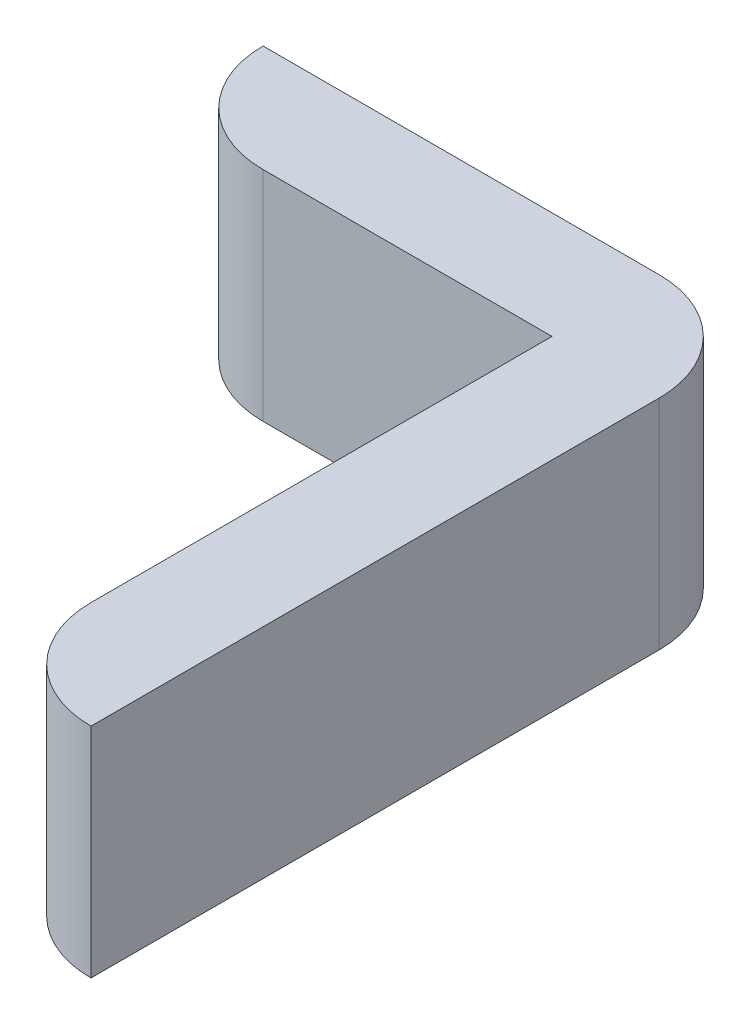
ISO-10303-21;
HEADER;
FILE_DESCRIPTION(('STEP AP214'),'2;1');
FILE_NAME('part.step','',(''),(''),'','','');
FILE_SCHEMA(('AUTOMOTIVE_DESIGN { 1 0 10303 214 1 1 1 1 }'));
ENDSEC;
DATA;
#1=APPLICATION_CONTEXT('core data for automotive mechanical design processes');
#2=APPLICATION_PROTOCOL_DEFINITION('international standard','automotive_design',2000,#1);
#3=PRODUCT_CONTEXT('',#1,'mechanical');
#4=PRODUCT('Part','Part','',(#3));
#5=PRODUCT_RELATED_PRODUCT_CATEGORY('part','',(#4));
#6=PRODUCT_DEFINITION_FORMATION('','',#4);
#7=PRODUCT_DEFINITION_CONTEXT('part definition',#1,'design');
#8=PRODUCT_DEFINITION('design','',#6,#7);
#9=PRODUCT_DEFINITION_SHAPE('','',#8);
#10=(LENGTH_UNIT() NAMED_UNIT(*) SI_UNIT(.MILLI.,.METRE.));
#11=(NAMED_UNIT(*) PLANE_ANGLE_UNIT() SI_UNIT($,.RADIAN.));
#12=(NAMED_UNIT(*) SI_UNIT($,.STERADIAN.) SOLID_ANGLE_UNIT());
#13=UNCERTAINTY_MEASURE_WITH_UNIT(LENGTH_MEASURE(1.E-05),#10,'distance_accuracy_value','');
#14=(GEOMETRIC_REPRESENTATION_CONTEXT(3) GLOBAL_UNCERTAINTY_ASSIGNED_CONTEXT((#13)) GLOBAL_UNIT_ASSIGNED_CONTEXT((#10,
#11,#12)) REPRESENTATION_CONTEXT('',''));
#15=CARTESIAN_POINT('',(0.,0.,0.));
#16=DIRECTION('',(0.,0.,1.));
#17=DIRECTION('',(1.,0.,0.));
#18=AXIS2_PLACEMENT_3D('',#15,#16,#17);
#19=CARTESIAN_POINT('',(-0.125,-7.3652,0.));
#20=DIRECTION('',(0.,-1.,0.));
#21=DIRECTION('',(0.,0.,-1.));
#22=AXIS2_PLACEMENT_3D('',#19,#20,#21);
#23=PLANE('',#22);
#24=DIRECTION('',(-1.,0.,0.));
#25=VECTOR('',#24,1.);
#26=CARTESIAN_POINT('',(0.125,-7.3652,0.25));
#27=LINE('',#26,#25);
#28=CARTESIAN_POINT('',(0.125,-7.3652,0.25));
#29=VERTEX_POINT('',#28);
#30=CARTESIAN_POINT('',(0.8,-7.3652,0.25));
#31=VERTEX_POINT('',#30);
#32=EDGE_CURVE('E102',#29,#31,#27,.F.);
#33=ORIENTED_EDGE('',*,*,#32,.T.);
#34=DIRECTION('',(0.,0.,-1.));
#35=VECTOR('',#34,1.);
#36=CARTESIAN_POINT('',(0.8,-7.3652,0.25));
#37=LINE('',#36,#35);
#38=CARTESIAN_POINT('',(0.8,-7.3652,1.327));
#39=VERTEX_POINT('',#38);
#40=EDGE_CURVE('E108',#31,#39,#37,.F.);
#41=ORIENTED_EDGE('',*,*,#40,.T.);
#42=CARTESIAN_POINT('',(1.05,-7.3652,1.327));
#43=DIRECTION('',(0.,-1.,0.));
#44=DIRECTION('',(0.,0.,-1.));
#45=AXIS2_PLACEMENT_3D('',#42,#43,#44);
#46=CIRCLE('',#45,0.25);
#47=CARTESIAN_POINT('',(1.05,-7.3652,1.577));
#48=VERTEX_POINT('',#47);
#49=EDGE_CURVE('E80',#48,#39,#46,.T.);
#50=ORIENTED_EDGE('',*,*,#49,.F.);
#51=DIRECTION('',(0.,0.,1.));
#52=VECTOR('',#51,1.);
#53=CARTESIAN_POINT('',(1.05,-7.3652,1.577));
#54=LINE('',#53,#52);
#55=CARTESIAN_POINT('',(1.05,-7.3652,0.25));
#56=VERTEX_POINT('',#55);
#57=EDGE_CURVE('E75',#48,#56,#54,.F.);
#58=ORIENTED_EDGE('',*,*,#57,.T.);
#59=CARTESIAN_POINT('',(0.8,-7.3652,0.25));
#60=DIRECTION('',(0.,-1.,0.));
#61=DIRECTION('',(0.,0.,-1.));
#62=AXIS2_PLACEMENT_3D('',#59,#60,#61);
#63=CIRCLE('',#62,0.25);
#64=CARTESIAN_POINT('',(0.8,-7.3652,0.));
#65=VERTEX_POINT('',#64);
#66=EDGE_CURVE('E19',#65,#56,#63,.T.);
#67=ORIENTED_EDGE('',*,*,#66,.F.);
#68=DIRECTION('',(1.,0.,0.));
#69=VECTOR('',#68,1.);
#70=CARTESIAN_POINT('',(0.8,-7.3652,0.));
#71=LINE('',#70,#69);
#72=CARTESIAN_POINT('',(-0.125,-7.3652,0.));
#73=VERTEX_POINT('',#72);
#74=EDGE_CURVE('E70',#65,#73,#71,.F.);
#75=ORIENTED_EDGE('',*,*,#74,.T.);
#76=CARTESIAN_POINT('',(0.125,-7.3652,0.));
#77=DIRECTION('',(0.,-1.,0.));
#78=DIRECTION('',(0.,0.,-1.));
#79=AXIS2_PLACEMENT_3D('',#76,#77,#78);
#80=CIRCLE('',#79,0.25);
#81=EDGE_CURVE('E121',#29,#73,#80,.T.);
#82=ORIENTED_EDGE('',*,*,#81,.F.);
#83=EDGE_LOOP('',(#33,#41,#50,#58,#67,#75,#82));
#84=FACE_BOUND('',#83,.T.);
#85=ADVANCED_FACE('F16',(#84),#23,.F.);
#86=CARTESIAN_POINT('',(0.8,-7.8748,0.));
#87=DIRECTION('',(0.,0.,1.));
#88=DIRECTION('',(1.,0.,0.));
#89=AXIS2_PLACEMENT_3D('',#86,#87,#88);
#90=PLANE('',#89);
#91=DIRECTION('',(0.,-1.,0.));
#92=VECTOR('',#91,1.);
#93=CARTESIAN_POINT('',(-0.125,-7.8748,0.));
#94=LINE('',#93,#92);
#95=CARTESIAN_POINT('',(-0.125,-7.8748,0.));
#96=VERTEX_POINT('',#95);
#97=EDGE_CURVE('E123',#73,#96,#94,.T.);
#98=ORIENTED_EDGE('',*,*,#97,.F.);
#99=ORIENTED_EDGE('',*,*,#74,.F.);
#100=DIRECTION('',(0.,-1.,0.));
#101=VECTOR('',#100,1.);
#102=CARTESIAN_POINT('',(0.8,-7.8748,0.));
#103=LINE('',#102,#101);
#104=CARTESIAN_POINT('',(0.8,-7.8748,0.));
#105=VERTEX_POINT('',#104);
#106=EDGE_CURVE('E92',#105,#65,#103,.F.);
#107=ORIENTED_EDGE('',*,*,#106,.F.);
#108=DIRECTION('',(1.,0.,0.));
#109=VECTOR('',#108,1.);
#110=CARTESIAN_POINT('',(-0.125,-7.8748,0.));
#111=LINE('',#110,#109);
#112=EDGE_CURVE('E120',#96,#105,#111,.T.);
#113=ORIENTED_EDGE('',*,*,#112,.F.);
#114=EDGE_LOOP('',(#98,#99,#107,#113));
#115=FACE_BOUND('',#114,.T.);
#116=ADVANCED_FACE('F158',(#115),#90,.F.);
#117=CARTESIAN_POINT('',(0.8,-7.8748,0.25));
#118=DIRECTION('',(0.,-1.,0.));
#119=DIRECTION('',(0.,0.,-1.));
#120=AXIS2_PLACEMENT_3D('',#117,#118,#119);
#121=CYLINDRICAL_SURFACE('',#120,0.25);
#122=ORIENTED_EDGE('',*,*,#66,.T.);
#123=DIRECTION('',(0.,1.,0.));
#124=VECTOR('',#123,1.);
#125=CARTESIAN_POINT('',(1.05,-7.8748,0.25));
#126=LINE('',#125,#124);
#127=CARTESIAN_POINT('',(1.05,-7.8748,0.25));
#128=VERTEX_POINT('',#127);
#129=EDGE_CURVE('E86',#56,#128,#126,.F.);
#130=ORIENTED_EDGE('',*,*,#129,.T.);
#131=CARTESIAN_POINT('',(0.8,-7.8748,0.25));
#132=DIRECTION('',(0.,-1.,0.));
#133=DIRECTION('',(0.,0.,-1.));
#134=AXIS2_PLACEMENT_3D('',#131,#132,#133);
#135=CIRCLE('',#134,0.25);
#136=EDGE_CURVE('E118',#105,#128,#135,.T.);
#137=ORIENTED_EDGE('',*,*,#136,.F.);
#138=ORIENTED_EDGE('',*,*,#106,.T.);
#139=EDGE_LOOP('',(#122,#130,#137,#138));
#140=FACE_BOUND('',#139,.T.);
#141=ADVANCED_FACE('F89',(#140),#121,.T.);
#142=CARTESIAN_POINT('',(1.05,-7.8748,1.577));
#143=DIRECTION('',(-1.,0.,0.));
#144=DIRECTION('',(0.,0.,1.));
#145=AXIS2_PLACEMENT_3D('',#142,#143,#144);
#146=PLANE('',#145);
#147=DIRECTION('',(0.,-1.,0.));
#148=VECTOR('',#147,1.);
#149=CARTESIAN_POINT('',(1.05,-7.8748,1.577));
#150=LINE('',#149,#148);
#151=CARTESIAN_POINT('',(1.05,-7.8748,1.577));
#152=VERTEX_POINT('',#151);
#153=EDGE_CURVE('E85',#152,#48,#150,.F.);
#154=ORIENTED_EDGE('',*,*,#153,.F.);
#155=DIRECTION('',(0.,0.,-1.));
#156=VECTOR('',#155,1.);
#157=CARTESIAN_POINT('',(1.05,-7.8748,0.));
#158=LINE('',#157,#156);
#159=EDGE_CURVE('E94',#128,#152,#158,.F.);
#160=ORIENTED_EDGE('',*,*,#159,.F.);
#161=ORIENTED_EDGE('',*,*,#129,.F.);
#162=ORIENTED_EDGE('',*,*,#57,.F.);
#163=EDGE_LOOP('',(#154,#160,#161,#162));
#164=FACE_BOUND('',#163,.T.);
#165=ADVANCED_FACE('F93',(#164),#146,.F.);
#166=CARTESIAN_POINT('',(1.05,-7.8748,1.327));
#167=DIRECTION('',(0.,-1.,0.));
#168=DIRECTION('',(0.,0.,-1.));
#169=AXIS2_PLACEMENT_3D('',#166,#167,#168);
#170=CYLINDRICAL_SURFACE('',#169,0.25);
#171=ORIENTED_EDGE('',*,*,#49,.T.);
#172=DIRECTION('',(0.,1.,0.));
#173=VECTOR('',#172,1.);
#174=CARTESIAN_POINT('',(0.8,-7.8748,1.327));
#175=LINE('',#174,#173);
#176=CARTESIAN_POINT('',(0.8,-7.8748,1.327));
#177=VERTEX_POINT('',#176);
#178=EDGE_CURVE('E105',#39,#177,#175,.F.);
#179=ORIENTED_EDGE('',*,*,#178,.T.);
#180=CARTESIAN_POINT('',(1.05,-7.8748,1.327));
#181=DIRECTION('',(0.,-1.,0.));
#182=DIRECTION('',(0.,0.,-1.));
#183=AXIS2_PLACEMENT_3D('',#180,#181,#182);
#184=CIRCLE('',#183,0.25);
#185=EDGE_CURVE('E114',#152,#177,#184,.T.);
#186=ORIENTED_EDGE('',*,*,#185,.F.);
#187=ORIENTED_EDGE('',*,*,#153,.T.);
#188=EDGE_LOOP('',(#171,#179,#186,#187));
#189=FACE_BOUND('',#188,.T.);
#190=ADVANCED_FACE('F127',(#189),#170,.T.);
#191=CARTESIAN_POINT('',(0.8,-7.8748,0.25));
#192=DIRECTION('',(1.,0.,0.));
#193=DIRECTION('',(0.,0.,-1.));
#194=AXIS2_PLACEMENT_3D('',#191,#192,#193);
#195=PLANE('',#194);
#196=ORIENTED_EDGE('',*,*,#178,.F.);
#197=ORIENTED_EDGE('',*,*,#40,.F.);
#198=DIRECTION('',(0.,1.,0.));
#199=VECTOR('',#198,1.);
#200=CARTESIAN_POINT('',(0.8,-7.8748,0.25));
#201=LINE('',#200,#199);
#202=CARTESIAN_POINT('',(0.8,-7.8748,0.25));
#203=VERTEX_POINT('',#202);
#204=EDGE_CURVE('E104',#31,#203,#201,.F.);
#205=ORIENTED_EDGE('',*,*,#204,.T.);
#206=DIRECTION('',(0.,0.,-1.));
#207=VECTOR('',#206,1.);
#208=CARTESIAN_POINT('',(0.8,-7.8748,0.));
#209=LINE('',#208,#207);
#210=EDGE_CURVE('E117',#177,#203,#209,.T.);
#211=ORIENTED_EDGE('',*,*,#210,.F.);
#212=EDGE_LOOP('',(#196,#197,#205,#211));
#213=FACE_BOUND('',#212,.T.);
#214=ADVANCED_FACE('F150',(#213),#195,.F.);
#215=CARTESIAN_POINT('',(0.125,-7.8748,0.25));
#216=DIRECTION('',(0.,0.,-1.));
#217=DIRECTION('',(-1.,0.,0.));
#218=AXIS2_PLACEMENT_3D('',#215,#216,#217);
#219=PLANE('',#218);
#220=ORIENTED_EDGE('',*,*,#204,.F.);
#221=ORIENTED_EDGE('',*,*,#32,.F.);
#222=DIRECTION('',(0.,-1.,0.));
#223=VECTOR('',#222,1.);
#224=CARTESIAN_POINT('',(0.125,-7.8748,0.25));
#225=LINE('',#224,#223);
#226=CARTESIAN_POINT('',(0.125,-7.8748,0.25));
#227=VERTEX_POINT('',#226);
#228=EDGE_CURVE('E34',#227,#29,#225,.F.);
#229=ORIENTED_EDGE('',*,*,#228,.F.);
#230=DIRECTION('',(1.,0.,0.));
#231=VECTOR('',#230,1.);
#232=CARTESIAN_POINT('',(-0.125,-7.8748,0.25));
#233=LINE('',#232,#231);
#234=EDGE_CURVE('E25',#203,#227,#233,.F.);
#235=ORIENTED_EDGE('',*,*,#234,.F.);
#236=EDGE_LOOP('',(#220,#221,#229,#235));
#237=FACE_BOUND('',#236,.T.);
#238=ADVANCED_FACE('F151',(#237),#219,.F.);
#239=CARTESIAN_POINT('',(0.125,-7.8748,0.));
#240=DIRECTION('',(0.,-1.,0.));
#241=DIRECTION('',(0.,0.,-1.));
#242=AXIS2_PLACEMENT_3D('',#239,#240,#241);
#243=CYLINDRICAL_SURFACE('',#242,0.25);
#244=ORIENTED_EDGE('',*,*,#81,.T.);
#245=ORIENTED_EDGE('',*,*,#97,.T.);
#246=CARTESIAN_POINT('',(0.125,-7.8748,0.));
#247=DIRECTION('',(0.,-1.,0.));
#248=DIRECTION('',(0.,0.,-1.));
#249=AXIS2_PLACEMENT_3D('',#246,#247,#248);
#250=CIRCLE('',#249,0.25);
#251=EDGE_CURVE('E11',#227,#96,#250,.T.);
#252=ORIENTED_EDGE('',*,*,#251,.F.);
#253=ORIENTED_EDGE('',*,*,#228,.T.);
#254=EDGE_LOOP('',(#244,#245,#252,#253));
#255=FACE_BOUND('',#254,.T.);
#256=ADVANCED_FACE('F156',(#255),#243,.T.);
#257=CARTESIAN_POINT('',(-0.125,-7.8748,0.));
#258=DIRECTION('',(0.,-1.,0.));
#259=DIRECTION('',(0.,0.,-1.));
#260=AXIS2_PLACEMENT_3D('',#257,#258,#259);
#261=PLANE('',#260);
#262=ORIENTED_EDGE('',*,*,#234,.T.);
#263=ORIENTED_EDGE('',*,*,#251,.T.);
#264=ORIENTED_EDGE('',*,*,#112,.T.);
#265=ORIENTED_EDGE('',*,*,#136,.T.);
#266=ORIENTED_EDGE('',*,*,#159,.T.);
#267=ORIENTED_EDGE('',*,*,#185,.T.);
#268=ORIENTED_EDGE('',*,*,#210,.T.);
#269=EDGE_LOOP('',(#262,#263,#264,#265,#266,#267,#268));
#270=FACE_BOUND('',#269,.T.);
#271=ADVANCED_FACE('F132',(#270),#261,.T.);
#272=CLOSED_SHELL('',(#85,#116,#141,#165,#190,#214,#238,#256,#271));
#273=MANIFOLD_SOLID_BREP('B1',#272);
#274=ADVANCED_BREP_SHAPE_REPRESENTATION('',(#18,#273),#14);
#275=SHAPE_DEFINITION_REPRESENTATION(#9,#274);
ENDSEC;
END-ISO-10303-21;
